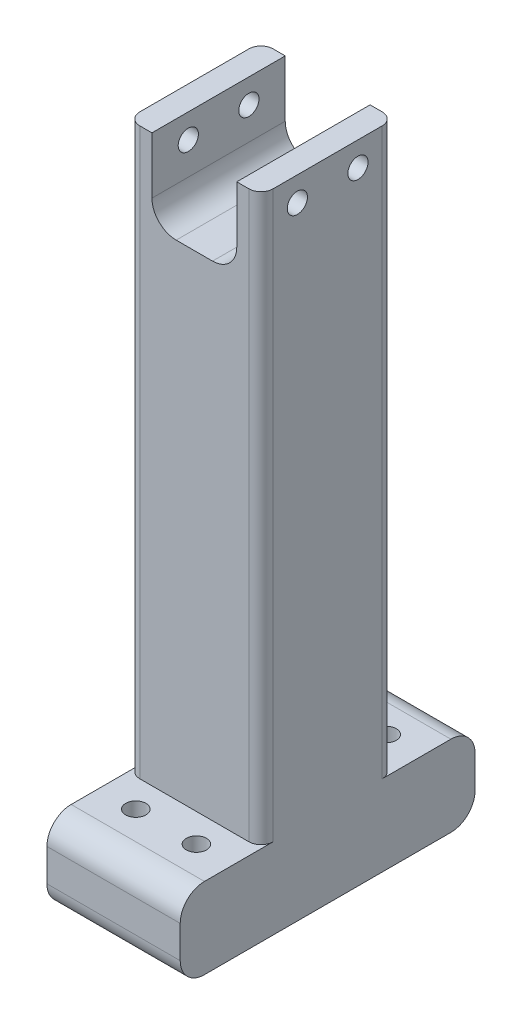
ISO-10303-21;
HEADER;
FILE_DESCRIPTION(('STEP AP214'),'2;1');
FILE_NAME('part.step','',(''),(''),'','','');
FILE_SCHEMA(('AUTOMOTIVE_DESIGN { 1 0 10303 214 1 1 1 1 }'));
ENDSEC;
DATA;
#1=APPLICATION_CONTEXT('core data for automotive mechanical design processes');
#2=APPLICATION_PROTOCOL_DEFINITION('international standard','automotive_design',2000,#1);
#3=PRODUCT_CONTEXT('',#1,'mechanical');
#4=PRODUCT('Part','Part','',(#3));
#5=PRODUCT_RELATED_PRODUCT_CATEGORY('part','',(#4));
#6=PRODUCT_DEFINITION_FORMATION('','',#4);
#7=PRODUCT_DEFINITION_CONTEXT('part definition',#1,'design');
#8=PRODUCT_DEFINITION('design','',#6,#7);
#9=PRODUCT_DEFINITION_SHAPE('','',#8);
#10=(LENGTH_UNIT() NAMED_UNIT(*) SI_UNIT(.MILLI.,.METRE.));
#11=(NAMED_UNIT(*) PLANE_ANGLE_UNIT() SI_UNIT($,.RADIAN.));
#12=(NAMED_UNIT(*) SI_UNIT($,.STERADIAN.) SOLID_ANGLE_UNIT());
#13=UNCERTAINTY_MEASURE_WITH_UNIT(LENGTH_MEASURE(1.E-05),#10,'distance_accuracy_value','');
#14=(GEOMETRIC_REPRESENTATION_CONTEXT(3) GLOBAL_UNCERTAINTY_ASSIGNED_CONTEXT((#13)) GLOBAL_UNIT_ASSIGNED_CONTEXT((#10,
#11,#12)) REPRESENTATION_CONTEXT('',''));
#15=CARTESIAN_POINT('',(0.,0.,0.));
#16=DIRECTION('',(0.,0.,1.));
#17=DIRECTION('',(1.,0.,0.));
#18=AXIS2_PLACEMENT_3D('',#15,#16,#17);
#19=CARTESIAN_POINT('',(-20.955,203.2,-20.955));
#20=DIRECTION('',(0.,0.,-1.));
#21=DIRECTION('',(-1.,0.,0.));
#22=AXIS2_PLACEMENT_3D('',#19,#20,#21);
#23=PLANE('',#22);
#24=DIRECTION('',(1.,0.,0.));
#25=VECTOR('',#24,1.);
#26=CARTESIAN_POINT('',(-20.955,203.2,-20.955));
#27=LINE('',#26,#25);
#28=CARTESIAN_POINT('',(13.335,203.2,-20.955));
#29=VERTEX_POINT('',#28);
#30=CARTESIAN_POINT('',(17.145,203.2,-20.955));
#31=VERTEX_POINT('',#30);
#32=EDGE_CURVE('E244',#29,#31,#27,.T.);
#33=ORIENTED_EDGE('',*,*,#32,.T.);
#34=DIRECTION('',(0.,-1.,0.));
#35=VECTOR('',#34,1.);
#36=CARTESIAN_POINT('',(17.145,203.2,-20.955));
#37=LINE('',#36,#35);
#38=CARTESIAN_POINT('',(17.145,25.4,-20.955));
#39=VERTEX_POINT('',#38);
#40=EDGE_CURVE('E267',#31,#39,#37,.T.);
#41=ORIENTED_EDGE('',*,*,#40,.T.);
#42=DIRECTION('',(-1.,0.,0.));
#43=VECTOR('',#42,1.);
#44=CARTESIAN_POINT('',(-20.955,25.4,-20.955));
#45=LINE('',#44,#43);
#46=CARTESIAN_POINT('',(-17.145,25.4,-20.955));
#47=VERTEX_POINT('',#46);
#48=EDGE_CURVE('E452',#39,#47,#45,.T.);
#49=ORIENTED_EDGE('',*,*,#48,.T.);
#50=DIRECTION('',(0.,-1.,0.));
#51=VECTOR('',#50,1.);
#52=CARTESIAN_POINT('',(-17.145,203.2,-20.955));
#53=LINE('',#52,#51);
#54=CARTESIAN_POINT('',(-17.145,203.2,-20.955));
#55=VERTEX_POINT('',#54);
#56=EDGE_CURVE('E253',#47,#55,#53,.F.);
#57=ORIENTED_EDGE('',*,*,#56,.T.);
#58=CARTESIAN_POINT('',(-13.335,203.2,-20.955));
#59=VERTEX_POINT('',#58);
#60=EDGE_CURVE('E241',#55,#59,#27,.T.);
#61=ORIENTED_EDGE('',*,*,#60,.T.);
#62=DIRECTION('',(0.,-1.,0.));
#63=VECTOR('',#62,1.);
#64=CARTESIAN_POINT('',(-13.335,185.42,-20.955));
#65=LINE('',#64,#63);
#66=CARTESIAN_POINT('',(-13.335,185.42,-20.955));
#67=VERTEX_POINT('',#66);
#68=EDGE_CURVE('E196',#59,#67,#65,.T.);
#69=ORIENTED_EDGE('',*,*,#68,.T.);
#70=CARTESIAN_POINT('',(-5.715,185.42,-20.955));
#71=DIRECTION('',(0.,0.,1.));
#72=DIRECTION('',(1.,0.,0.));
#73=AXIS2_PLACEMENT_3D('',#70,#71,#72);
#74=CIRCLE('',#73,7.61999999999999);
#75=CARTESIAN_POINT('',(-5.715,177.8,-20.955));
#76=VERTEX_POINT('',#75);
#77=EDGE_CURVE('E188',#67,#76,#74,.T.);
#78=ORIENTED_EDGE('',*,*,#77,.T.);
#79=DIRECTION('',(1.,0.,0.));
#80=VECTOR('',#79,1.);
#81=CARTESIAN_POINT('',(5.715,177.8,-20.955));
#82=LINE('',#81,#80);
#83=CARTESIAN_POINT('',(5.715,177.8,-20.955));
#84=VERTEX_POINT('',#83);
#85=EDGE_CURVE('E199',#76,#84,#82,.T.);
#86=ORIENTED_EDGE('',*,*,#85,.T.);
#87=CARTESIAN_POINT('',(5.715,185.42,-20.955));
#88=DIRECTION('',(0.,0.,1.));
#89=DIRECTION('',(-1.,0.,0.));
#90=AXIS2_PLACEMENT_3D('',#87,#88,#89);
#91=CIRCLE('',#90,7.61999999999999);
#92=CARTESIAN_POINT('',(13.335,185.42,-20.955));
#93=VERTEX_POINT('',#92);
#94=EDGE_CURVE('E204',#84,#93,#91,.T.);
#95=ORIENTED_EDGE('',*,*,#94,.T.);
#96=DIRECTION('',(0.,1.,0.));
#97=VECTOR('',#96,1.);
#98=CARTESIAN_POINT('',(13.335,203.2,-20.955));
#99=LINE('',#98,#97);
#100=EDGE_CURVE('E218',#93,#29,#99,.T.);
#101=ORIENTED_EDGE('',*,*,#100,.T.);
#102=EDGE_LOOP('',(#33,#41,#49,#57,#61,#69,#78,#86,#95,#101));
#103=FACE_BOUND('',#102,.T.);
#104=ADVANCED_FACE('F34',(#103),#23,.T.);
#105=CARTESIAN_POINT('',(0.,203.2,0.));
#106=DIRECTION('',(0.,-1.,0.));
#107=DIRECTION('',(0.,0.,-1.));
#108=AXIS2_PLACEMENT_3D('',#105,#106,#107);
#109=PLANE('',#108);
#110=ORIENTED_EDGE('',*,*,#60,.F.);
#111=CARTESIAN_POINT('',(-17.145,203.2,-17.145));
#112=DIRECTION('',(0.,-1.,0.));
#113=DIRECTION('',(0.,0.,-1.));
#114=AXIS2_PLACEMENT_3D('',#111,#112,#113);
#115=CIRCLE('',#114,3.81);
#116=CARTESIAN_POINT('',(-20.955,203.2,-17.145));
#117=VERTEX_POINT('',#116);
#118=EDGE_CURVE('E291',#55,#117,#115,.F.);
#119=ORIENTED_EDGE('',*,*,#118,.T.);
#120=DIRECTION('',(0.,0.,-1.));
#121=VECTOR('',#120,1.);
#122=CARTESIAN_POINT('',(-20.955,203.2,-20.955));
#123=LINE('',#122,#121);
#124=CARTESIAN_POINT('',(-20.955,203.2,17.145));
#125=VERTEX_POINT('',#124);
#126=EDGE_CURVE('E250',#125,#117,#123,.T.);
#127=ORIENTED_EDGE('',*,*,#126,.F.);
#128=CARTESIAN_POINT('',(-17.145,203.2,17.145));
#129=DIRECTION('',(0.,-1.,0.));
#130=DIRECTION('',(0.,0.,-1.));
#131=AXIS2_PLACEMENT_3D('',#128,#129,#130);
#132=CIRCLE('',#131,3.81);
#133=CARTESIAN_POINT('',(-17.145,203.2,20.955));
#134=VERTEX_POINT('',#133);
#135=EDGE_CURVE('E289',#125,#134,#132,.F.);
#136=ORIENTED_EDGE('',*,*,#135,.T.);
#137=DIRECTION('',(-1.,0.,0.));
#138=VECTOR('',#137,1.);
#139=CARTESIAN_POINT('',(-20.955,203.2,20.955));
#140=LINE('',#139,#138);
#141=CARTESIAN_POINT('',(-13.335,203.2,20.955));
#142=VERTEX_POINT('',#141);
#143=EDGE_CURVE('E247',#142,#134,#140,.T.);
#144=ORIENTED_EDGE('',*,*,#143,.F.);
#145=DIRECTION('',(0.,0.,1.));
#146=VECTOR('',#145,1.);
#147=CARTESIAN_POINT('',(-13.335,203.2,-20.955));
#148=LINE('',#147,#146);
#149=EDGE_CURVE('E233',#59,#142,#148,.T.);
#150=ORIENTED_EDGE('',*,*,#149,.F.);
#151=EDGE_LOOP('',(#110,#119,#127,#136,#144,#150));
#152=FACE_BOUND('',#151,.T.);
#153=ADVANCED_FACE('F393',(#152),#109,.F.);
#154=CARTESIAN_POINT('',(-20.955,203.2,-20.955));
#155=DIRECTION('',(-1.,0.,0.));
#156=DIRECTION('',(0.,0.,1.));
#157=AXIS2_PLACEMENT_3D('',#154,#155,#156);
#158=PLANE('',#157);
#159=CARTESIAN_POINT('',(-20.955,195.58,-9.525));
#160=DIRECTION('',(-1.,0.,0.));
#161=DIRECTION('',(0.,0.,1.));
#162=AXIS2_PLACEMENT_3D('',#159,#160,#161);
#163=CIRCLE('',#162,3.175);
#164=CARTESIAN_POINT('',(-20.955,195.58,-6.35));
#165=VERTEX_POINT('',#164);
#166=EDGE_CURVE('E361',#165,#165,#163,.T.);
#167=ORIENTED_EDGE('',*,*,#166,.F.);
#168=EDGE_LOOP('',(#167));
#169=FACE_BOUND('',#168,.T.);
#170=CARTESIAN_POINT('',(-20.955,195.58,9.525));
#171=DIRECTION('',(-1.,0.,0.));
#172=DIRECTION('',(0.,0.,1.));
#173=AXIS2_PLACEMENT_3D('',#170,#171,#172);
#174=CIRCLE('',#173,3.175);
#175=CARTESIAN_POINT('',(-20.955,195.58,12.7));
#176=VERTEX_POINT('',#175);
#177=EDGE_CURVE('E358',#176,#176,#174,.T.);
#178=ORIENTED_EDGE('',*,*,#177,.F.);
#179=EDGE_LOOP('',(#178));
#180=FACE_BOUND('',#179,.T.);
#181=DIRECTION('',(0.,0.,1.));
#182=VECTOR('',#181,1.);
#183=CARTESIAN_POINT('',(-20.955,25.4,-46.355));
#184=LINE('',#183,#182);
#185=CARTESIAN_POINT('',(-20.955,25.4,-38.735));
#186=VERTEX_POINT('',#185);
#187=CARTESIAN_POINT('',(-20.955,25.4,-17.145));
#188=VERTEX_POINT('',#187);
#189=EDGE_CURVE('E464',#186,#188,#184,.T.);
#190=ORIENTED_EDGE('',*,*,#189,.F.);
#191=CARTESIAN_POINT('',(-20.955,17.78,-38.735));
#192=DIRECTION('',(-1.,0.,0.));
#193=DIRECTION('',(0.,0.,1.));
#194=AXIS2_PLACEMENT_3D('',#191,#192,#193);
#195=CIRCLE('',#194,7.62);
#196=CARTESIAN_POINT('',(-20.955,17.78,-46.355));
#197=VERTEX_POINT('',#196);
#198=EDGE_CURVE('E312',#186,#197,#195,.T.);
#199=ORIENTED_EDGE('',*,*,#198,.T.);
#200=DIRECTION('',(0.,-1.,0.));
#201=VECTOR('',#200,1.);
#202=CARTESIAN_POINT('',(-20.955,0.,-46.355));
#203=LINE('',#202,#201);
#204=CARTESIAN_POINT('',(-20.955,7.62,-46.355));
#205=VERTEX_POINT('',#204);
#206=EDGE_CURVE('E449',#197,#205,#203,.T.);
#207=ORIENTED_EDGE('',*,*,#206,.T.);
#208=CARTESIAN_POINT('',(-20.955,7.62,-38.735));
#209=DIRECTION('',(-1.,0.,0.));
#210=DIRECTION('',(0.,0.,1.));
#211=AXIS2_PLACEMENT_3D('',#208,#209,#210);
#212=CIRCLE('',#211,7.62);
#213=CARTESIAN_POINT('',(-20.955,0.,-38.735));
#214=VERTEX_POINT('',#213);
#215=EDGE_CURVE('E310',#205,#214,#212,.T.);
#216=ORIENTED_EDGE('',*,*,#215,.T.);
#217=DIRECTION('',(0.,0.,-1.));
#218=VECTOR('',#217,1.);
#219=CARTESIAN_POINT('',(-20.955,0.,-20.955));
#220=LINE('',#219,#218);
#221=CARTESIAN_POINT('',(-20.955,0.,38.735));
#222=VERTEX_POINT('',#221);
#223=EDGE_CURVE('E255',#222,#214,#220,.T.);
#224=ORIENTED_EDGE('',*,*,#223,.F.);
#225=CARTESIAN_POINT('',(-20.955,7.62,38.735));
#226=DIRECTION('',(-1.,0.,0.));
#227=DIRECTION('',(0.,0.,1.));
#228=AXIS2_PLACEMENT_3D('',#225,#226,#227);
#229=CIRCLE('',#228,7.62);
#230=CARTESIAN_POINT('',(-20.955,7.62,46.355));
#231=VERTEX_POINT('',#230);
#232=EDGE_CURVE('E308',#222,#231,#229,.T.);
#233=ORIENTED_EDGE('',*,*,#232,.T.);
#234=DIRECTION('',(0.,-1.,0.));
#235=VECTOR('',#234,1.);
#236=CARTESIAN_POINT('',(-20.955,0.,46.355));
#237=LINE('',#236,#235);
#238=CARTESIAN_POINT('',(-20.955,17.78,46.355));
#239=VERTEX_POINT('',#238);
#240=EDGE_CURVE('E339',#239,#231,#237,.T.);
#241=ORIENTED_EDGE('',*,*,#240,.F.);
#242=CARTESIAN_POINT('',(-20.955,17.78,38.735));
#243=DIRECTION('',(-1.,0.,0.));
#244=DIRECTION('',(0.,0.,1.));
#245=AXIS2_PLACEMENT_3D('',#242,#243,#244);
#246=CIRCLE('',#245,7.62);
#247=CARTESIAN_POINT('',(-20.955,25.4,38.735));
#248=VERTEX_POINT('',#247);
#249=EDGE_CURVE('E306',#239,#248,#246,.T.);
#250=ORIENTED_EDGE('',*,*,#249,.T.);
#251=DIRECTION('',(0.,0.,-1.));
#252=VECTOR('',#251,1.);
#253=CARTESIAN_POINT('',(-20.955,25.4,46.355));
#254=LINE('',#253,#252);
#255=CARTESIAN_POINT('',(-20.955,25.4,17.145));
#256=VERTEX_POINT('',#255);
#257=EDGE_CURVE('E346',#248,#256,#254,.T.);
#258=ORIENTED_EDGE('',*,*,#257,.T.);
#259=DIRECTION('',(0.,-1.,0.));
#260=VECTOR('',#259,1.);
#261=CARTESIAN_POINT('',(-20.955,203.2,17.145));
#262=LINE('',#261,#260);
#263=EDGE_CURVE('E284',#256,#125,#262,.F.);
#264=ORIENTED_EDGE('',*,*,#263,.T.);
#265=ORIENTED_EDGE('',*,*,#126,.T.);
#266=DIRECTION('',(0.,-1.,0.));
#267=VECTOR('',#266,1.);
#268=CARTESIAN_POINT('',(-20.955,203.2,-17.145));
#269=LINE('',#268,#267);
#270=EDGE_CURVE('E286',#117,#188,#269,.T.);
#271=ORIENTED_EDGE('',*,*,#270,.T.);
#272=EDGE_LOOP('',(#190,#199,#207,#216,#224,#233,#241,#250,#258,#264,#265,#271));
#273=FACE_BOUND('',#272,.T.);
#274=ADVANCED_FACE('F398',(#169,#180,#273),#158,.T.);
#275=CARTESIAN_POINT('',(-20.955,203.2,20.955));
#276=DIRECTION('',(0.,0.,1.));
#277=DIRECTION('',(1.,0.,0.));
#278=AXIS2_PLACEMENT_3D('',#275,#276,#277);
#279=PLANE('',#278);
#280=DIRECTION('',(-1.,0.,0.));
#281=VECTOR('',#280,1.);
#282=CARTESIAN_POINT('',(-20.955,25.4,20.955));
#283=LINE('',#282,#281);
#284=CARTESIAN_POINT('',(17.145,25.4,20.955));
#285=VERTEX_POINT('',#284);
#286=CARTESIAN_POINT('',(-17.145,25.4,20.955));
#287=VERTEX_POINT('',#286);
#288=EDGE_CURVE('E350',#285,#287,#283,.T.);
#289=ORIENTED_EDGE('',*,*,#288,.F.);
#290=DIRECTION('',(0.,-1.,0.));
#291=VECTOR('',#290,1.);
#292=CARTESIAN_POINT('',(17.145,203.2,20.955));
#293=LINE('',#292,#291);
#294=CARTESIAN_POINT('',(17.145,203.2,20.955));
#295=VERTEX_POINT('',#294);
#296=EDGE_CURVE('E282',#285,#295,#293,.F.);
#297=ORIENTED_EDGE('',*,*,#296,.T.);
#298=CARTESIAN_POINT('',(13.335,203.2,20.955));
#299=VERTEX_POINT('',#298);
#300=EDGE_CURVE('E248',#295,#299,#140,.T.);
#301=ORIENTED_EDGE('',*,*,#300,.T.);
#302=DIRECTION('',(0.,1.,0.));
#303=VECTOR('',#302,1.);
#304=CARTESIAN_POINT('',(13.335,203.2,20.955));
#305=LINE('',#304,#303);
#306=CARTESIAN_POINT('',(13.335,185.42,20.955));
#307=VERTEX_POINT('',#306);
#308=EDGE_CURVE('E211',#307,#299,#305,.T.);
#309=ORIENTED_EDGE('',*,*,#308,.F.);
#310=CARTESIAN_POINT('',(5.715,185.42,20.955));
#311=DIRECTION('',(0.,0.,1.));
#312=DIRECTION('',(-1.,0.,0.));
#313=AXIS2_PLACEMENT_3D('',#310,#311,#312);
#314=CIRCLE('',#313,7.61999999999999);
#315=CARTESIAN_POINT('',(5.715,177.8,20.955));
#316=VERTEX_POINT('',#315);
#317=EDGE_CURVE('E225',#316,#307,#314,.T.);
#318=ORIENTED_EDGE('',*,*,#317,.F.);
#319=DIRECTION('',(1.,0.,0.));
#320=VECTOR('',#319,1.);
#321=CARTESIAN_POINT('',(5.715,177.8,20.955));
#322=LINE('',#321,#320);
#323=CARTESIAN_POINT('',(-5.715,177.8,20.955));
#324=VERTEX_POINT('',#323);
#325=EDGE_CURVE('E223',#324,#316,#322,.T.);
#326=ORIENTED_EDGE('',*,*,#325,.F.);
#327=CARTESIAN_POINT('',(-5.715,185.42,20.955));
#328=DIRECTION('',(0.,0.,1.));
#329=DIRECTION('',(1.,0.,0.));
#330=AXIS2_PLACEMENT_3D('',#327,#328,#329);
#331=CIRCLE('',#330,7.61999999999999);
#332=CARTESIAN_POINT('',(-13.335,185.42,20.955));
#333=VERTEX_POINT('',#332);
#334=EDGE_CURVE('E191',#333,#324,#331,.T.);
#335=ORIENTED_EDGE('',*,*,#334,.F.);
#336=DIRECTION('',(0.,-1.,0.));
#337=VECTOR('',#336,1.);
#338=CARTESIAN_POINT('',(-13.335,185.42,20.955));
#339=LINE('',#338,#337);
#340=EDGE_CURVE('E208',#142,#333,#339,.T.);
#341=ORIENTED_EDGE('',*,*,#340,.F.);
#342=ORIENTED_EDGE('',*,*,#143,.T.);
#343=DIRECTION('',(0.,-1.,0.));
#344=VECTOR('',#343,1.);
#345=CARTESIAN_POINT('',(-17.145,203.2,20.955));
#346=LINE('',#345,#344);
#347=EDGE_CURVE('E279',#134,#287,#346,.T.);
#348=ORIENTED_EDGE('',*,*,#347,.T.);
#349=EDGE_LOOP('',(#289,#297,#301,#309,#318,#326,#335,#341,#342,#348));
#350=FACE_BOUND('',#349,.T.);
#351=ADVANCED_FACE('F496',(#350),#279,.T.);
#352=CARTESIAN_POINT('',(20.955,203.2,-20.955));
#353=DIRECTION('',(1.,0.,0.));
#354=DIRECTION('',(0.,0.,-1.));
#355=AXIS2_PLACEMENT_3D('',#352,#353,#354);
#356=PLANE('',#355);
#357=CARTESIAN_POINT('',(20.955,195.58,-9.525));
#358=DIRECTION('',(-1.,0.,0.));
#359=DIRECTION('',(0.,0.,1.));
#360=AXIS2_PLACEMENT_3D('',#357,#358,#359);
#361=CIRCLE('',#360,3.175);
#362=CARTESIAN_POINT('',(20.955,195.58,-6.35));
#363=VERTEX_POINT('',#362);
#364=EDGE_CURVE('E262',#363,#363,#361,.T.);
#365=ORIENTED_EDGE('',*,*,#364,.T.);
#366=EDGE_LOOP('',(#365));
#367=FACE_BOUND('',#366,.T.);
#368=CARTESIAN_POINT('',(20.955,195.58,9.525));
#369=DIRECTION('',(-1.,0.,0.));
#370=DIRECTION('',(0.,0.,1.));
#371=AXIS2_PLACEMENT_3D('',#368,#369,#370);
#372=CIRCLE('',#371,3.175);
#373=CARTESIAN_POINT('',(20.955,195.58,12.7));
#374=VERTEX_POINT('',#373);
#375=EDGE_CURVE('E364',#374,#374,#372,.T.);
#376=ORIENTED_EDGE('',*,*,#375,.T.);
#377=EDGE_LOOP('',(#376));
#378=FACE_BOUND('',#377,.T.);
#379=DIRECTION('',(0.,1.,0.));
#380=VECTOR('',#379,1.);
#381=CARTESIAN_POINT('',(20.955,0.,-46.355));
#382=LINE('',#381,#380);
#383=CARTESIAN_POINT('',(20.955,7.62,-46.355));
#384=VERTEX_POINT('',#383);
#385=CARTESIAN_POINT('',(20.955,17.78,-46.355));
#386=VERTEX_POINT('',#385);
#387=EDGE_CURVE('E451',#384,#386,#382,.T.);
#388=ORIENTED_EDGE('',*,*,#387,.T.);
#389=CARTESIAN_POINT('',(20.955,17.78,-38.735));
#390=DIRECTION('',(1.,0.,0.));
#391=DIRECTION('',(0.,0.,-1.));
#392=AXIS2_PLACEMENT_3D('',#389,#390,#391);
#393=CIRCLE('',#392,7.62);
#394=CARTESIAN_POINT('',(20.955,25.4,-38.735));
#395=VERTEX_POINT('',#394);
#396=EDGE_CURVE('E322',#386,#395,#393,.T.);
#397=ORIENTED_EDGE('',*,*,#396,.T.);
#398=DIRECTION('',(0.,0.,1.));
#399=VECTOR('',#398,1.);
#400=CARTESIAN_POINT('',(20.955,25.4,-46.355));
#401=LINE('',#400,#399);
#402=CARTESIAN_POINT('',(20.955,25.4,-17.145));
#403=VERTEX_POINT('',#402);
#404=EDGE_CURVE('E454',#395,#403,#401,.T.);
#405=ORIENTED_EDGE('',*,*,#404,.T.);
#406=DIRECTION('',(0.,-1.,0.));
#407=VECTOR('',#406,1.);
#408=CARTESIAN_POINT('',(20.955,203.2,-17.145));
#409=LINE('',#408,#407);
#410=CARTESIAN_POINT('',(20.955,203.2,-17.145));
#411=VERTEX_POINT('',#410);
#412=EDGE_CURVE('E273',#403,#411,#409,.F.);
#413=ORIENTED_EDGE('',*,*,#412,.T.);
#414=DIRECTION('',(0.,0.,1.));
#415=VECTOR('',#414,1.);
#416=CARTESIAN_POINT('',(20.955,203.2,-20.955));
#417=LINE('',#416,#415);
#418=CARTESIAN_POINT('',(20.955,203.2,17.145));
#419=VERTEX_POINT('',#418);
#420=EDGE_CURVE('E243',#411,#419,#417,.T.);
#421=ORIENTED_EDGE('',*,*,#420,.T.);
#422=DIRECTION('',(0.,-1.,0.));
#423=VECTOR('',#422,1.);
#424=CARTESIAN_POINT('',(20.955,203.2,17.145));
#425=LINE('',#424,#423);
#426=CARTESIAN_POINT('',(20.955,25.4,17.145));
#427=VERTEX_POINT('',#426);
#428=EDGE_CURVE('E270',#419,#427,#425,.T.);
#429=ORIENTED_EDGE('',*,*,#428,.T.);
#430=DIRECTION('',(0.,0.,-1.));
#431=VECTOR('',#430,1.);
#432=CARTESIAN_POINT('',(20.955,25.4,46.355));
#433=LINE('',#432,#431);
#434=CARTESIAN_POINT('',(20.955,25.4,38.735));
#435=VERTEX_POINT('',#434);
#436=EDGE_CURVE('E348',#435,#427,#433,.T.);
#437=ORIENTED_EDGE('',*,*,#436,.F.);
#438=CARTESIAN_POINT('',(20.955,17.78,38.735));
#439=DIRECTION('',(1.,0.,0.));
#440=DIRECTION('',(0.,0.,-1.));
#441=AXIS2_PLACEMENT_3D('',#438,#439,#440);
#442=CIRCLE('',#441,7.62);
#443=CARTESIAN_POINT('',(20.955,17.78,46.355));
#444=VERTEX_POINT('',#443);
#445=EDGE_CURVE('E318',#435,#444,#442,.T.);
#446=ORIENTED_EDGE('',*,*,#445,.T.);
#447=DIRECTION('',(0.,1.,0.));
#448=VECTOR('',#447,1.);
#449=CARTESIAN_POINT('',(20.955,0.,46.355));
#450=LINE('',#449,#448);
#451=CARTESIAN_POINT('',(20.955,7.62,46.355));
#452=VERTEX_POINT('',#451);
#453=EDGE_CURVE('E336',#452,#444,#450,.T.);
#454=ORIENTED_EDGE('',*,*,#453,.F.);
#455=CARTESIAN_POINT('',(20.955,7.62,38.735));
#456=DIRECTION('',(1.,0.,0.));
#457=DIRECTION('',(0.,0.,-1.));
#458=AXIS2_PLACEMENT_3D('',#455,#456,#457);
#459=CIRCLE('',#458,7.62);
#460=CARTESIAN_POINT('',(20.955,0.,38.735));
#461=VERTEX_POINT('',#460);
#462=EDGE_CURVE('E49',#452,#461,#459,.T.);
#463=ORIENTED_EDGE('',*,*,#462,.T.);
#464=DIRECTION('',(0.,0.,1.));
#465=VECTOR('',#464,1.);
#466=CARTESIAN_POINT('',(20.955,0.,-20.955));
#467=LINE('',#466,#465);
#468=CARTESIAN_POINT('',(20.955,0.,-38.735));
#469=VERTEX_POINT('',#468);
#470=EDGE_CURVE('E232',#469,#461,#467,.T.);
#471=ORIENTED_EDGE('',*,*,#470,.F.);
#472=CARTESIAN_POINT('',(20.955,7.62,-38.735));
#473=DIRECTION('',(1.,0.,0.));
#474=DIRECTION('',(0.,0.,-1.));
#475=AXIS2_PLACEMENT_3D('',#472,#473,#474);
#476=CIRCLE('',#475,7.62);
#477=EDGE_CURVE('E57',#469,#384,#476,.T.);
#478=ORIENTED_EDGE('',*,*,#477,.T.);
#479=EDGE_LOOP('',(#388,#397,#405,#413,#421,#429,#437,#446,#454,#463,#471,#478));
#480=FACE_BOUND('',#479,.T.);
#481=ADVANCED_FACE('F343',(#367,#378,#480),#356,.T.);
#482=ORIENTED_EDGE('',*,*,#420,.F.);
#483=CARTESIAN_POINT('',(17.145,203.2,-17.145));
#484=DIRECTION('',(0.,-1.,0.));
#485=DIRECTION('',(0.,0.,-1.));
#486=AXIS2_PLACEMENT_3D('',#483,#484,#485);
#487=CIRCLE('',#486,3.81);
#488=EDGE_CURVE('E277',#411,#31,#487,.F.);
#489=ORIENTED_EDGE('',*,*,#488,.T.);
#490=ORIENTED_EDGE('',*,*,#32,.F.);
#491=DIRECTION('',(0.,0.,1.));
#492=VECTOR('',#491,1.);
#493=CARTESIAN_POINT('',(13.335,203.2,-20.955));
#494=LINE('',#493,#492);
#495=EDGE_CURVE('E235',#29,#299,#494,.T.);
#496=ORIENTED_EDGE('',*,*,#495,.T.);
#497=ORIENTED_EDGE('',*,*,#300,.F.);
#498=CARTESIAN_POINT('',(17.145,203.2,17.145));
#499=DIRECTION('',(0.,-1.,0.));
#500=DIRECTION('',(0.,0.,-1.));
#501=AXIS2_PLACEMENT_3D('',#498,#499,#500);
#502=CIRCLE('',#501,3.81);
#503=EDGE_CURVE('E275',#295,#419,#502,.F.);
#504=ORIENTED_EDGE('',*,*,#503,.T.);
#505=EDGE_LOOP('',(#482,#489,#490,#496,#497,#504));
#506=FACE_BOUND('',#505,.T.);
#507=ADVANCED_FACE('F401',(#506),#109,.F.);
#508=CARTESIAN_POINT('',(0.,0.,0.));
#509=DIRECTION('',(0.,-1.,0.));
#510=DIRECTION('',(0.,0.,-1.));
#511=AXIS2_PLACEMENT_3D('',#508,#509,#510);
#512=PLANE('',#511);
#513=CARTESIAN_POINT('',(-9.525,0.,-29.845));
#514=DIRECTION('',(0.,-1.,0.));
#515=DIRECTION('',(-1.,0.,0.));
#516=AXIS2_PLACEMENT_3D('',#513,#514,#515);
#517=CIRCLE('',#516,3.175);
#518=CARTESIAN_POINT('',(-12.7,0.,-29.845));
#519=VERTEX_POINT('',#518);
#520=EDGE_CURVE('E457',#519,#519,#517,.T.);
#521=ORIENTED_EDGE('',*,*,#520,.F.);
#522=EDGE_LOOP('',(#521));
#523=FACE_BOUND('',#522,.T.);
#524=CARTESIAN_POINT('',(9.525,0.,-29.845));
#525=DIRECTION('',(0.,-1.,0.));
#526=DIRECTION('',(-1.,0.,0.));
#527=AXIS2_PLACEMENT_3D('',#524,#525,#526);
#528=CIRCLE('',#527,3.175);
#529=CARTESIAN_POINT('',(6.35,0.,-29.845));
#530=VERTEX_POINT('',#529);
#531=EDGE_CURVE('E774',#530,#530,#528,.T.);
#532=ORIENTED_EDGE('',*,*,#531,.F.);
#533=EDGE_LOOP('',(#532));
#534=FACE_BOUND('',#533,.T.);
#535=CARTESIAN_POINT('',(-9.525,0.,29.845));
#536=DIRECTION('',(0.,1.,0.));
#537=DIRECTION('',(-1.,0.,0.));
#538=AXIS2_PLACEMENT_3D('',#535,#536,#537);
#539=CIRCLE('',#538,3.175);
#540=CARTESIAN_POINT('',(-12.7,0.,29.845));
#541=VERTEX_POINT('',#540);
#542=EDGE_CURVE('E355',#541,#541,#539,.T.);
#543=ORIENTED_EDGE('',*,*,#542,.T.);
#544=EDGE_LOOP('',(#543));
#545=FACE_BOUND('',#544,.T.);
#546=CARTESIAN_POINT('',(9.525,0.,29.845));
#547=DIRECTION('',(0.,1.,0.));
#548=DIRECTION('',(-1.,0.,0.));
#549=AXIS2_PLACEMENT_3D('',#546,#547,#548);
#550=CIRCLE('',#549,3.175);
#551=CARTESIAN_POINT('',(6.35,0.,29.845));
#552=VERTEX_POINT('',#551);
#553=EDGE_CURVE('E472',#552,#552,#550,.T.);
#554=ORIENTED_EDGE('',*,*,#553,.T.);
#555=EDGE_LOOP('',(#554));
#556=FACE_BOUND('',#555,.T.);
#557=ORIENTED_EDGE('',*,*,#223,.T.);
#558=DIRECTION('',(1.,0.,0.));
#559=VECTOR('',#558,1.);
#560=CARTESIAN_POINT('',(20.955,0.,-38.735));
#561=LINE('',#560,#559);
#562=EDGE_CURVE('E326',#214,#469,#561,.T.);
#563=ORIENTED_EDGE('',*,*,#562,.T.);
#564=ORIENTED_EDGE('',*,*,#470,.T.);
#565=DIRECTION('',(1.,0.,0.));
#566=VECTOR('',#565,1.);
#567=CARTESIAN_POINT('',(-20.955,0.,38.735));
#568=LINE('',#567,#566);
#569=EDGE_CURVE('E324',#461,#222,#568,.F.);
#570=ORIENTED_EDGE('',*,*,#569,.T.);
#571=EDGE_LOOP('',(#557,#563,#564,#570));
#572=FACE_BOUND('',#571,.T.);
#573=ADVANCED_FACE('F405',(#523,#534,#545,#556,#572),#512,.T.);
#574=CARTESIAN_POINT('',(-5.715,185.42,-20.955));
#575=DIRECTION('',(0.,0.,1.));
#576=DIRECTION('',(1.,0.,0.));
#577=AXIS2_PLACEMENT_3D('',#574,#575,#576);
#578=CYLINDRICAL_SURFACE('',#577,7.61999999999999);
#579=ORIENTED_EDGE('',*,*,#334,.T.);
#580=DIRECTION('',(0.,0.,1.));
#581=VECTOR('',#580,1.);
#582=CARTESIAN_POINT('',(-5.715,177.8,-20.955));
#583=LINE('',#582,#581);
#584=EDGE_CURVE('E184',#76,#324,#583,.T.);
#585=ORIENTED_EDGE('',*,*,#584,.F.);
#586=ORIENTED_EDGE('',*,*,#77,.F.);
#587=DIRECTION('',(0.,0.,1.));
#588=VECTOR('',#587,1.);
#589=CARTESIAN_POINT('',(-13.335,185.42,-20.955));
#590=LINE('',#589,#588);
#591=EDGE_CURVE('E230',#67,#333,#590,.T.);
#592=ORIENTED_EDGE('',*,*,#591,.T.);
#593=EDGE_LOOP('',(#579,#585,#586,#592));
#594=FACE_BOUND('',#593,.T.);
#595=ADVANCED_FACE('F186',(#594),#578,.F.);
#596=CARTESIAN_POINT('',(-13.335,185.42,-20.955));
#597=DIRECTION('',(-1.,0.,0.));
#598=DIRECTION('',(0.,0.,1.));
#599=AXIS2_PLACEMENT_3D('',#596,#597,#598);
#600=PLANE('',#599);
#601=CARTESIAN_POINT('',(-13.335,195.58,-9.525));
#602=DIRECTION('',(-1.,0.,0.));
#603=DIRECTION('',(0.,0.,1.));
#604=AXIS2_PLACEMENT_3D('',#601,#602,#603);
#605=CIRCLE('',#604,3.175);
#606=CARTESIAN_POINT('',(-13.335,195.58,-6.35));
#607=VERTEX_POINT('',#606);
#608=EDGE_CURVE('E214',#607,#607,#605,.T.);
#609=ORIENTED_EDGE('',*,*,#608,.T.);
#610=EDGE_LOOP('',(#609));
#611=FACE_BOUND('',#610,.T.);
#612=CARTESIAN_POINT('',(-13.335,195.58,9.525));
#613=DIRECTION('',(-1.,0.,0.));
#614=DIRECTION('',(0.,0.,1.));
#615=AXIS2_PLACEMENT_3D('',#612,#613,#614);
#616=CIRCLE('',#615,3.175);
#617=CARTESIAN_POINT('',(-13.335,195.58,12.7));
#618=VERTEX_POINT('',#617);
#619=EDGE_CURVE('E261',#618,#618,#616,.T.);
#620=ORIENTED_EDGE('',*,*,#619,.T.);
#621=EDGE_LOOP('',(#620));
#622=FACE_BOUND('',#621,.T.);
#623=ORIENTED_EDGE('',*,*,#340,.T.);
#624=ORIENTED_EDGE('',*,*,#591,.F.);
#625=ORIENTED_EDGE('',*,*,#68,.F.);
#626=ORIENTED_EDGE('',*,*,#149,.T.);
#627=EDGE_LOOP('',(#623,#624,#625,#626));
#628=FACE_BOUND('',#627,.T.);
#629=ADVANCED_FACE('F371',(#611,#622,#628),#600,.F.);
#630=CARTESIAN_POINT('',(13.335,203.2,-20.955));
#631=DIRECTION('',(1.,0.,0.));
#632=DIRECTION('',(0.,0.,-1.));
#633=AXIS2_PLACEMENT_3D('',#630,#631,#632);
#634=PLANE('',#633);
#635=CARTESIAN_POINT('',(13.335,195.58,-9.525));
#636=DIRECTION('',(1.,0.,0.));
#637=DIRECTION('',(0.,0.,-1.));
#638=AXIS2_PLACEMENT_3D('',#635,#636,#637);
#639=CIRCLE('',#638,3.175);
#640=CARTESIAN_POINT('',(13.335,195.58,-12.7));
#641=VERTEX_POINT('',#640);
#642=EDGE_CURVE('E263',#641,#641,#639,.T.);
#643=ORIENTED_EDGE('',*,*,#642,.T.);
#644=EDGE_LOOP('',(#643));
#645=FACE_BOUND('',#644,.T.);
#646=CARTESIAN_POINT('',(13.335,195.58,9.525));
#647=DIRECTION('',(1.,0.,0.));
#648=DIRECTION('',(0.,0.,-1.));
#649=AXIS2_PLACEMENT_3D('',#646,#647,#648);
#650=CIRCLE('',#649,3.175);
#651=CARTESIAN_POINT('',(13.335,195.58,6.35));
#652=VERTEX_POINT('',#651);
#653=EDGE_CURVE('E258',#652,#652,#650,.T.);
#654=ORIENTED_EDGE('',*,*,#653,.T.);
#655=EDGE_LOOP('',(#654));
#656=FACE_BOUND('',#655,.T.);
#657=ORIENTED_EDGE('',*,*,#308,.T.);
#658=ORIENTED_EDGE('',*,*,#495,.F.);
#659=ORIENTED_EDGE('',*,*,#100,.F.);
#660=DIRECTION('',(0.,0.,1.));
#661=VECTOR('',#660,1.);
#662=CARTESIAN_POINT('',(13.335,185.42,-20.955));
#663=LINE('',#662,#661);
#664=EDGE_CURVE('E238',#93,#307,#663,.T.);
#665=ORIENTED_EDGE('',*,*,#664,.T.);
#666=EDGE_LOOP('',(#657,#658,#659,#665));
#667=FACE_BOUND('',#666,.T.);
#668=ADVANCED_FACE('F522',(#645,#656,#667),#634,.F.);
#669=CARTESIAN_POINT('',(5.715,185.42,-20.955));
#670=DIRECTION('',(0.,0.,1.));
#671=DIRECTION('',(1.,0.,0.));
#672=AXIS2_PLACEMENT_3D('',#669,#670,#671);
#673=CYLINDRICAL_SURFACE('',#672,7.61999999999999);
#674=ORIENTED_EDGE('',*,*,#317,.T.);
#675=ORIENTED_EDGE('',*,*,#664,.F.);
#676=ORIENTED_EDGE('',*,*,#94,.F.);
#677=DIRECTION('',(0.,0.,1.));
#678=VECTOR('',#677,1.);
#679=CARTESIAN_POINT('',(5.715,177.8,-20.955));
#680=LINE('',#679,#678);
#681=EDGE_CURVE('E195',#84,#316,#680,.T.);
#682=ORIENTED_EDGE('',*,*,#681,.T.);
#683=EDGE_LOOP('',(#674,#675,#676,#682));
#684=FACE_BOUND('',#683,.T.);
#685=ADVANCED_FACE('F519',(#684),#673,.F.);
#686=CARTESIAN_POINT('',(5.715,177.8,-20.955));
#687=DIRECTION('',(0.,-1.,0.));
#688=DIRECTION('',(0.,0.,-1.));
#689=AXIS2_PLACEMENT_3D('',#686,#687,#688);
#690=PLANE('',#689);
#691=ORIENTED_EDGE('',*,*,#325,.T.);
#692=ORIENTED_EDGE('',*,*,#681,.F.);
#693=ORIENTED_EDGE('',*,*,#85,.F.);
#694=ORIENTED_EDGE('',*,*,#584,.T.);
#695=EDGE_LOOP('',(#691,#692,#693,#694));
#696=FACE_BOUND('',#695,.T.);
#697=ADVANCED_FACE('F200',(#696),#690,.F.);
#698=CARTESIAN_POINT('',(20.955,195.58,9.525));
#699=DIRECTION('',(-1.,0.,0.));
#700=DIRECTION('',(0.,0.,1.));
#701=AXIS2_PLACEMENT_3D('',#698,#699,#700);
#702=CYLINDRICAL_SURFACE('',#701,3.175);
#703=ORIENTED_EDGE('',*,*,#375,.F.);
#704=EDGE_LOOP('',(#703));
#705=FACE_BOUND('',#704,.T.);
#706=ORIENTED_EDGE('',*,*,#653,.F.);
#707=EDGE_LOOP('',(#706));
#708=FACE_BOUND('',#707,.T.);
#709=ADVANCED_FACE('F380',(#705,#708),#702,.F.);
#710=CARTESIAN_POINT('',(20.955,195.58,-9.525));
#711=DIRECTION('',(-1.,0.,0.));
#712=DIRECTION('',(0.,0.,1.));
#713=AXIS2_PLACEMENT_3D('',#710,#711,#712);
#714=CYLINDRICAL_SURFACE('',#713,3.175);
#715=ORIENTED_EDGE('',*,*,#364,.F.);
#716=EDGE_LOOP('',(#715));
#717=FACE_BOUND('',#716,.T.);
#718=ORIENTED_EDGE('',*,*,#642,.F.);
#719=EDGE_LOOP('',(#718));
#720=FACE_BOUND('',#719,.T.);
#721=ADVANCED_FACE('F377',(#717,#720),#714,.F.);
#722=ORIENTED_EDGE('',*,*,#177,.T.);
#723=EDGE_LOOP('',(#722));
#724=FACE_BOUND('',#723,.T.);
#725=ORIENTED_EDGE('',*,*,#619,.F.);
#726=EDGE_LOOP('',(#725));
#727=FACE_BOUND('',#726,.T.);
#728=ADVANCED_FACE('F374',(#724,#727),#702,.F.);
#729=ORIENTED_EDGE('',*,*,#166,.T.);
#730=EDGE_LOOP('',(#729));
#731=FACE_BOUND('',#730,.T.);
#732=ORIENTED_EDGE('',*,*,#608,.F.);
#733=EDGE_LOOP('',(#732));
#734=FACE_BOUND('',#733,.T.);
#735=ADVANCED_FACE('F376',(#731,#734),#714,.F.);
#736=CARTESIAN_POINT('',(-20.955,25.4,46.355));
#737=DIRECTION('',(0.,-1.,0.));
#738=DIRECTION('',(1.,0.,0.));
#739=AXIS2_PLACEMENT_3D('',#736,#737,#738);
#740=PLANE('',#739);
#741=CARTESIAN_POINT('',(-9.525,25.4,29.845));
#742=DIRECTION('',(0.,1.,0.));
#743=DIRECTION('',(-1.,0.,0.));
#744=AXIS2_PLACEMENT_3D('',#741,#742,#743);
#745=CIRCLE('',#744,3.175);
#746=CARTESIAN_POINT('',(-12.7,25.4,29.845));
#747=VERTEX_POINT('',#746);
#748=EDGE_CURVE('E469',#747,#747,#745,.T.);
#749=ORIENTED_EDGE('',*,*,#748,.F.);
#750=EDGE_LOOP('',(#749));
#751=FACE_BOUND('',#750,.T.);
#752=CARTESIAN_POINT('',(9.525,25.4,29.845));
#753=DIRECTION('',(0.,1.,0.));
#754=DIRECTION('',(-1.,0.,0.));
#755=AXIS2_PLACEMENT_3D('',#752,#753,#754);
#756=CIRCLE('',#755,3.175);
#757=CARTESIAN_POINT('',(6.35,25.4,29.845));
#758=VERTEX_POINT('',#757);
#759=EDGE_CURVE('E466',#758,#758,#756,.T.);
#760=ORIENTED_EDGE('',*,*,#759,.F.);
#761=EDGE_LOOP('',(#760));
#762=FACE_BOUND('',#761,.T.);
#763=ORIENTED_EDGE('',*,*,#257,.F.);
#764=DIRECTION('',(-1.,0.,0.));
#765=VECTOR('',#764,1.);
#766=CARTESIAN_POINT('',(-20.955,25.4,38.735));
#767=LINE('',#766,#765);
#768=EDGE_CURVE('E11',#248,#435,#767,.F.);
#769=ORIENTED_EDGE('',*,*,#768,.T.);
#770=ORIENTED_EDGE('',*,*,#436,.T.);
#771=CARTESIAN_POINT('',(17.145,25.4,17.145));
#772=DIRECTION('',(0.,-1.,0.));
#773=DIRECTION('',(1.,0.,0.));
#774=AXIS2_PLACEMENT_3D('',#771,#772,#773);
#775=CIRCLE('',#774,3.81);
#776=EDGE_CURVE('E296',#427,#285,#775,.T.);
#777=ORIENTED_EDGE('',*,*,#776,.T.);
#778=ORIENTED_EDGE('',*,*,#288,.T.);
#779=CARTESIAN_POINT('',(-17.145,25.4,17.145));
#780=DIRECTION('',(0.,-1.,0.));
#781=DIRECTION('',(1.,0.,0.));
#782=AXIS2_PLACEMENT_3D('',#779,#780,#781);
#783=CIRCLE('',#782,3.81);
#784=EDGE_CURVE('E300',#287,#256,#783,.T.);
#785=ORIENTED_EDGE('',*,*,#784,.T.);
#786=EDGE_LOOP('',(#763,#769,#770,#777,#778,#785));
#787=FACE_BOUND('',#786,.T.);
#788=ADVANCED_FACE('F385',(#751,#762,#787),#740,.F.);
#789=CARTESIAN_POINT('',(0.,0.,46.355));
#790=DIRECTION('',(0.,0.,-1.));
#791=DIRECTION('',(-1.,0.,0.));
#792=AXIS2_PLACEMENT_3D('',#789,#790,#791);
#793=PLANE('',#792);
#794=ORIENTED_EDGE('',*,*,#240,.T.);
#795=DIRECTION('',(1.,0.,0.));
#796=VECTOR('',#795,1.);
#797=CARTESIAN_POINT('',(20.955,7.62,46.355));
#798=LINE('',#797,#796);
#799=EDGE_CURVE('E42',#231,#452,#798,.T.);
#800=ORIENTED_EDGE('',*,*,#799,.T.);
#801=ORIENTED_EDGE('',*,*,#453,.T.);
#802=DIRECTION('',(-1.,0.,0.));
#803=VECTOR('',#802,1.);
#804=CARTESIAN_POINT('',(0.,17.78,46.355));
#805=LINE('',#804,#803);
#806=EDGE_CURVE('E328',#444,#239,#805,.T.);
#807=ORIENTED_EDGE('',*,*,#806,.T.);
#808=EDGE_LOOP('',(#794,#800,#801,#807));
#809=FACE_BOUND('',#808,.T.);
#810=ADVANCED_FACE('F335',(#809),#793,.F.);
#811=CARTESIAN_POINT('',(9.525,0.,29.845));
#812=DIRECTION('',(0.,1.,0.));
#813=DIRECTION('',(-1.,0.,0.));
#814=AXIS2_PLACEMENT_3D('',#811,#812,#813);
#815=CYLINDRICAL_SURFACE('',#814,3.175);
#816=ORIENTED_EDGE('',*,*,#553,.F.);
#817=EDGE_LOOP('',(#816));
#818=FACE_BOUND('',#817,.T.);
#819=ORIENTED_EDGE('',*,*,#759,.T.);
#820=EDGE_LOOP('',(#819));
#821=FACE_BOUND('',#820,.T.);
#822=ADVANCED_FACE('F477',(#818,#821),#815,.F.);
#823=CARTESIAN_POINT('',(-9.525,0.,29.845));
#824=DIRECTION('',(0.,1.,0.));
#825=DIRECTION('',(-1.,0.,0.));
#826=AXIS2_PLACEMENT_3D('',#823,#824,#825);
#827=CYLINDRICAL_SURFACE('',#826,3.175);
#828=ORIENTED_EDGE('',*,*,#542,.F.);
#829=EDGE_LOOP('',(#828));
#830=FACE_BOUND('',#829,.T.);
#831=ORIENTED_EDGE('',*,*,#748,.T.);
#832=EDGE_LOOP('',(#831));
#833=FACE_BOUND('',#832,.T.);
#834=ADVANCED_FACE('F615',(#830,#833),#827,.F.);
#835=CARTESIAN_POINT('',(-20.955,25.4,-46.355));
#836=DIRECTION('',(0.,1.,0.));
#837=DIRECTION('',(-1.,0.,0.));
#838=AXIS2_PLACEMENT_3D('',#835,#836,#837);
#839=PLANE('',#838);
#840=CARTESIAN_POINT('',(-9.525,25.4,-29.845));
#841=DIRECTION('',(0.,-1.,0.));
#842=DIRECTION('',(-1.,0.,0.));
#843=AXIS2_PLACEMENT_3D('',#840,#841,#842);
#844=CIRCLE('',#843,3.175);
#845=CARTESIAN_POINT('',(-12.7,25.4,-29.845));
#846=VERTEX_POINT('',#845);
#847=EDGE_CURVE('E770',#846,#846,#844,.T.);
#848=ORIENTED_EDGE('',*,*,#847,.T.);
#849=EDGE_LOOP('',(#848));
#850=FACE_BOUND('',#849,.T.);
#851=CARTESIAN_POINT('',(9.525,25.4,-29.845));
#852=DIRECTION('',(0.,-1.,0.));
#853=DIRECTION('',(-1.,0.,0.));
#854=AXIS2_PLACEMENT_3D('',#851,#852,#853);
#855=CIRCLE('',#854,3.175);
#856=CARTESIAN_POINT('',(6.35,25.4,-29.845));
#857=VERTEX_POINT('',#856);
#858=EDGE_CURVE('E460',#857,#857,#855,.T.);
#859=ORIENTED_EDGE('',*,*,#858,.T.);
#860=EDGE_LOOP('',(#859));
#861=FACE_BOUND('',#860,.T.);
#862=ORIENTED_EDGE('',*,*,#404,.F.);
#863=DIRECTION('',(-1.,0.,0.));
#864=VECTOR('',#863,1.);
#865=CARTESIAN_POINT('',(-20.955,25.4,-38.735));
#866=LINE('',#865,#864);
#867=EDGE_CURVE('E303',#395,#186,#866,.T.);
#868=ORIENTED_EDGE('',*,*,#867,.T.);
#869=ORIENTED_EDGE('',*,*,#189,.T.);
#870=CARTESIAN_POINT('',(-17.145,25.4,-17.145));
#871=DIRECTION('',(0.,1.,0.));
#872=DIRECTION('',(-1.,0.,0.));
#873=AXIS2_PLACEMENT_3D('',#870,#871,#872);
#874=CIRCLE('',#873,3.81);
#875=EDGE_CURVE('E298',#188,#47,#874,.F.);
#876=ORIENTED_EDGE('',*,*,#875,.T.);
#877=ORIENTED_EDGE('',*,*,#48,.F.);
#878=CARTESIAN_POINT('',(17.145,25.4,-17.145));
#879=DIRECTION('',(0.,1.,0.));
#880=DIRECTION('',(-1.,0.,0.));
#881=AXIS2_PLACEMENT_3D('',#878,#879,#880);
#882=CIRCLE('',#881,3.81);
#883=EDGE_CURVE('E293',#39,#403,#882,.F.);
#884=ORIENTED_EDGE('',*,*,#883,.T.);
#885=EDGE_LOOP('',(#862,#868,#869,#876,#877,#884));
#886=FACE_BOUND('',#885,.T.);
#887=ADVANCED_FACE('F513',(#850,#861,#886),#839,.T.);
#888=CARTESIAN_POINT('',(0.,0.,-46.355));
#889=DIRECTION('',(0.,0.,1.));
#890=DIRECTION('',(-1.,0.,0.));
#891=AXIS2_PLACEMENT_3D('',#888,#889,#890);
#892=PLANE('',#891);
#893=ORIENTED_EDGE('',*,*,#206,.F.);
#894=DIRECTION('',(-1.,0.,0.));
#895=VECTOR('',#894,1.);
#896=CARTESIAN_POINT('',(20.955,17.78,-46.355));
#897=LINE('',#896,#895);
#898=EDGE_CURVE('E316',#197,#386,#897,.F.);
#899=ORIENTED_EDGE('',*,*,#898,.T.);
#900=ORIENTED_EDGE('',*,*,#387,.F.);
#901=DIRECTION('',(1.,0.,0.));
#902=VECTOR('',#901,1.);
#903=CARTESIAN_POINT('',(-20.955,7.62,-46.355));
#904=LINE('',#903,#902);
#905=EDGE_CURVE('E314',#384,#205,#904,.F.);
#906=ORIENTED_EDGE('',*,*,#905,.T.);
#907=EDGE_LOOP('',(#893,#899,#900,#906));
#908=FACE_BOUND('',#907,.T.);
#909=ADVANCED_FACE('F448',(#908),#892,.F.);
#910=CARTESIAN_POINT('',(9.525,0.,-29.845));
#911=DIRECTION('',(0.,1.,0.));
#912=DIRECTION('',(-1.,0.,0.));
#913=AXIS2_PLACEMENT_3D('',#910,#911,#912);
#914=CYLINDRICAL_SURFACE('',#913,3.175);
#915=ORIENTED_EDGE('',*,*,#531,.T.);
#916=EDGE_LOOP('',(#915));
#917=FACE_BOUND('',#916,.T.);
#918=ORIENTED_EDGE('',*,*,#858,.F.);
#919=EDGE_LOOP('',(#918));
#920=FACE_BOUND('',#919,.T.);
#921=ADVANCED_FACE('F634',(#917,#920),#914,.F.);
#922=CARTESIAN_POINT('',(-9.525,0.,-29.845));
#923=DIRECTION('',(0.,1.,0.));
#924=DIRECTION('',(-1.,0.,0.));
#925=AXIS2_PLACEMENT_3D('',#922,#923,#924);
#926=CYLINDRICAL_SURFACE('',#925,3.175);
#927=ORIENTED_EDGE('',*,*,#520,.T.);
#928=EDGE_LOOP('',(#927));
#929=FACE_BOUND('',#928,.T.);
#930=ORIENTED_EDGE('',*,*,#847,.F.);
#931=EDGE_LOOP('',(#930));
#932=FACE_BOUND('',#931,.T.);
#933=ADVANCED_FACE('F413',(#929,#932),#926,.F.);
#934=CARTESIAN_POINT('',(17.145,203.2,-17.145));
#935=DIRECTION('',(0.,-1.,0.));
#936=DIRECTION('',(0.,0.,-1.));
#937=AXIS2_PLACEMENT_3D('',#934,#935,#936);
#938=CYLINDRICAL_SURFACE('',#937,3.81);
#939=ORIENTED_EDGE('',*,*,#488,.F.);
#940=ORIENTED_EDGE('',*,*,#412,.F.);
#941=ORIENTED_EDGE('',*,*,#883,.F.);
#942=ORIENTED_EDGE('',*,*,#40,.F.);
#943=EDGE_LOOP('',(#939,#940,#941,#942));
#944=FACE_BOUND('',#943,.T.);
#945=ADVANCED_FACE('F409',(#944),#938,.T.);
#946=CARTESIAN_POINT('',(17.145,203.2,17.145));
#947=DIRECTION('',(0.,-1.,0.));
#948=DIRECTION('',(0.,0.,-1.));
#949=AXIS2_PLACEMENT_3D('',#946,#947,#948);
#950=CYLINDRICAL_SURFACE('',#949,3.81);
#951=ORIENTED_EDGE('',*,*,#503,.F.);
#952=ORIENTED_EDGE('',*,*,#296,.F.);
#953=ORIENTED_EDGE('',*,*,#776,.F.);
#954=ORIENTED_EDGE('',*,*,#428,.F.);
#955=EDGE_LOOP('',(#951,#952,#953,#954));
#956=FACE_BOUND('',#955,.T.);
#957=ADVANCED_FACE('F412',(#956),#950,.T.);
#958=CARTESIAN_POINT('',(-17.145,203.2,-17.145));
#959=DIRECTION('',(0.,-1.,0.));
#960=DIRECTION('',(0.,0.,-1.));
#961=AXIS2_PLACEMENT_3D('',#958,#959,#960);
#962=CYLINDRICAL_SURFACE('',#961,3.81);
#963=ORIENTED_EDGE('',*,*,#118,.F.);
#964=ORIENTED_EDGE('',*,*,#56,.F.);
#965=ORIENTED_EDGE('',*,*,#875,.F.);
#966=ORIENTED_EDGE('',*,*,#270,.F.);
#967=EDGE_LOOP('',(#963,#964,#965,#966));
#968=FACE_BOUND('',#967,.T.);
#969=ADVANCED_FACE('F417',(#968),#962,.T.);
#970=CARTESIAN_POINT('',(-17.145,203.2,17.145));
#971=DIRECTION('',(0.,-1.,0.));
#972=DIRECTION('',(0.,0.,-1.));
#973=AXIS2_PLACEMENT_3D('',#970,#971,#972);
#974=CYLINDRICAL_SURFACE('',#973,3.81);
#975=ORIENTED_EDGE('',*,*,#135,.F.);
#976=ORIENTED_EDGE('',*,*,#263,.F.);
#977=ORIENTED_EDGE('',*,*,#784,.F.);
#978=ORIENTED_EDGE('',*,*,#347,.F.);
#979=EDGE_LOOP('',(#975,#976,#977,#978));
#980=FACE_BOUND('',#979,.T.);
#981=ADVANCED_FACE('F421',(#980),#974,.T.);
#982=CARTESIAN_POINT('',(-20.955,17.78,-38.735));
#983=DIRECTION('',(1.,0.,0.));
#984=DIRECTION('',(0.,1.,0.));
#985=AXIS2_PLACEMENT_3D('',#982,#983,#984);
#986=CYLINDRICAL_SURFACE('',#985,7.62);
#987=ORIENTED_EDGE('',*,*,#396,.F.);
#988=ORIENTED_EDGE('',*,*,#898,.F.);
#989=ORIENTED_EDGE('',*,*,#198,.F.);
#990=ORIENTED_EDGE('',*,*,#867,.F.);
#991=EDGE_LOOP('',(#987,#988,#989,#990));
#992=FACE_BOUND('',#991,.T.);
#993=ADVANCED_FACE('F425',(#992),#986,.T.);
#994=CARTESIAN_POINT('',(0.,7.62,-38.735));
#995=DIRECTION('',(-1.,0.,0.));
#996=DIRECTION('',(0.,0.,1.));
#997=AXIS2_PLACEMENT_3D('',#994,#995,#996);
#998=CYLINDRICAL_SURFACE('',#997,7.62);
#999=ORIENTED_EDGE('',*,*,#215,.F.);
#1000=ORIENTED_EDGE('',*,*,#905,.F.);
#1001=ORIENTED_EDGE('',*,*,#477,.F.);
#1002=ORIENTED_EDGE('',*,*,#562,.F.);
#1003=EDGE_LOOP('',(#999,#1000,#1001,#1002));
#1004=FACE_BOUND('',#1003,.T.);
#1005=ADVANCED_FACE('F429',(#1004),#998,.T.);
#1006=CARTESIAN_POINT('',(0.,7.62,38.735));
#1007=DIRECTION('',(-1.,0.,0.));
#1008=DIRECTION('',(0.,0.,1.));
#1009=AXIS2_PLACEMENT_3D('',#1006,#1007,#1008);
#1010=CYLINDRICAL_SURFACE('',#1009,7.62);
#1011=ORIENTED_EDGE('',*,*,#232,.F.);
#1012=ORIENTED_EDGE('',*,*,#569,.F.);
#1013=ORIENTED_EDGE('',*,*,#462,.F.);
#1014=ORIENTED_EDGE('',*,*,#799,.F.);
#1015=EDGE_LOOP('',(#1011,#1012,#1013,#1014));
#1016=FACE_BOUND('',#1015,.T.);
#1017=ADVANCED_FACE('F432',(#1016),#1010,.T.);
#1018=CARTESIAN_POINT('',(0.,17.78,38.735));
#1019=DIRECTION('',(-1.,0.,0.));
#1020=DIRECTION('',(0.,-1.,0.));
#1021=AXIS2_PLACEMENT_3D('',#1018,#1019,#1020);
#1022=CYLINDRICAL_SURFACE('',#1021,7.62);
#1023=ORIENTED_EDGE('',*,*,#445,.F.);
#1024=ORIENTED_EDGE('',*,*,#768,.F.);
#1025=ORIENTED_EDGE('',*,*,#249,.F.);
#1026=ORIENTED_EDGE('',*,*,#806,.F.);
#1027=EDGE_LOOP('',(#1023,#1024,#1025,#1026));
#1028=FACE_BOUND('',#1027,.T.);
#1029=ADVANCED_FACE('F36',(#1028),#1022,.T.);
#1030=CLOSED_SHELL('',(#104,#153,#274,#351,#481,#507,#573,#595,#629,#668,#685,#697,#709,#721,
#728,#735,#788,#810,#822,#834,#887,#909,#921,#933,#945,#957,#969,#981,#993,#1005,#1017,#1029));
#1031=MANIFOLD_SOLID_BREP('B2',#1030);
#1032=ADVANCED_BREP_SHAPE_REPRESENTATION('',(#18,#1031),#14);
#1033=SHAPE_DEFINITION_REPRESENTATION(#9,#1032);
ENDSEC;
END-ISO-10303-21;
